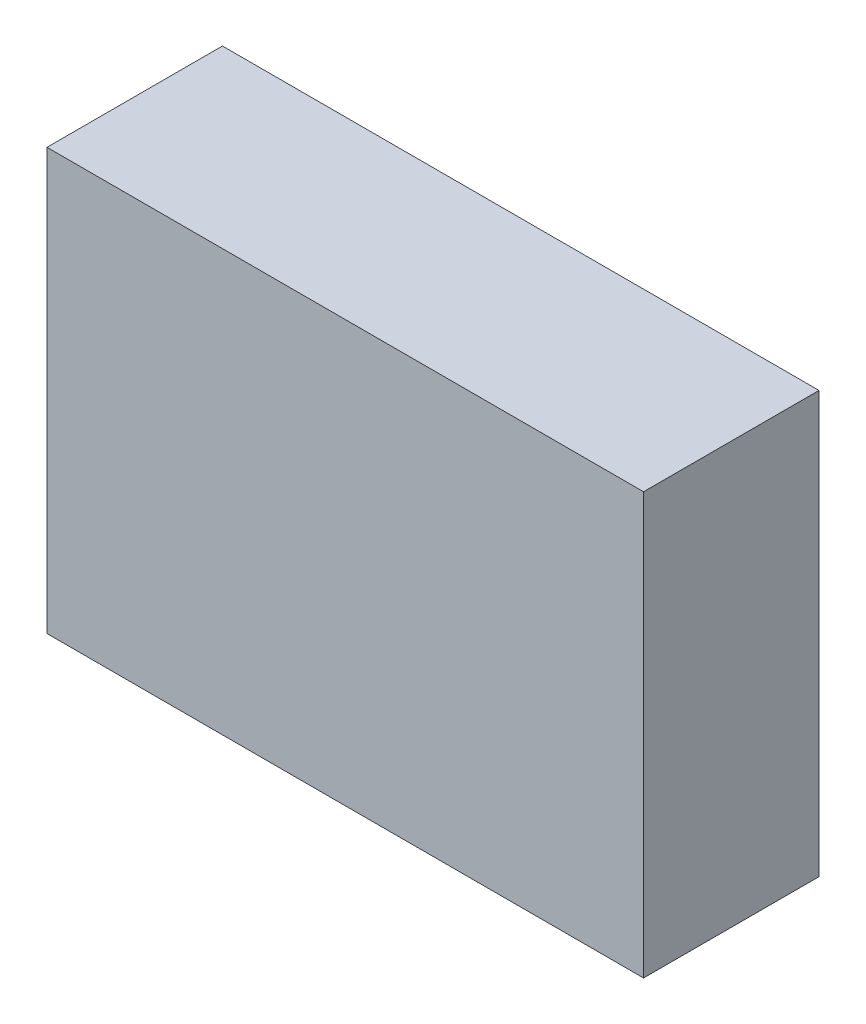
ISO-10303-21;
HEADER;
FILE_DESCRIPTION(('STEP AP214'),'2;1');
FILE_NAME('part.step','',(''),(''),'','','');
FILE_SCHEMA(('AUTOMOTIVE_DESIGN { 1 0 10303 214 1 1 1 1 }'));
ENDSEC;
DATA;
#1=APPLICATION_CONTEXT('core data for automotive mechanical design processes');
#2=APPLICATION_PROTOCOL_DEFINITION('international standard','automotive_design',2000,#1);
#3=PRODUCT_CONTEXT('',#1,'mechanical');
#4=PRODUCT('Part','Part','',(#3));
#5=PRODUCT_RELATED_PRODUCT_CATEGORY('part','',(#4));
#6=PRODUCT_DEFINITION_FORMATION('','',#4);
#7=PRODUCT_DEFINITION_CONTEXT('part definition',#1,'design');
#8=PRODUCT_DEFINITION('design','',#6,#7);
#9=PRODUCT_DEFINITION_SHAPE('','',#8);
#10=(LENGTH_UNIT() NAMED_UNIT(*) SI_UNIT(.MILLI.,.METRE.));
#11=(NAMED_UNIT(*) PLANE_ANGLE_UNIT() SI_UNIT($,.RADIAN.));
#12=(NAMED_UNIT(*) SI_UNIT($,.STERADIAN.) SOLID_ANGLE_UNIT());
#13=UNCERTAINTY_MEASURE_WITH_UNIT(LENGTH_MEASURE(1.E-05),#10,'distance_accuracy_value','');
#14=(GEOMETRIC_REPRESENTATION_CONTEXT(3) GLOBAL_UNCERTAINTY_ASSIGNED_CONTEXT((#13)) GLOBAL_UNIT_ASSIGNED_CONTEXT((#10,
#11,#12)) REPRESENTATION_CONTEXT('',''));
#15=CARTESIAN_POINT('',(0.,0.,0.));
#16=DIRECTION('',(0.,0.,1.));
#17=DIRECTION('',(1.,0.,0.));
#18=AXIS2_PLACEMENT_3D('',#15,#16,#17);
#19=CARTESIAN_POINT('',(-2.92,-1.37,0.));
#20=DIRECTION('',(1.,0.,0.));
#21=DIRECTION('',(0.,0.,1.));
#22=AXIS2_PLACEMENT_3D('',#19,#20,#21);
#23=PLANE('',#22);
#24=DIRECTION('',(0.,1.,0.));
#25=VECTOR('',#24,1.);
#26=CARTESIAN_POINT('',(-2.92,-1.37,0.1));
#27=LINE('',#26,#25);
#28=CARTESIAN_POINT('',(-2.92,-1.37,0.1));
#29=VERTEX_POINT('',#28);
#30=CARTESIAN_POINT('',(-2.92,-1.13,0.1));
#31=VERTEX_POINT('',#30);
#32=EDGE_CURVE('E11',#29,#31,#27,.T.);
#33=ORIENTED_EDGE('',*,*,#32,.T.);
#34=DIRECTION('',(0.,0.,1.));
#35=VECTOR('',#34,1.);
#36=CARTESIAN_POINT('',(-2.92,-1.13,0.));
#37=LINE('',#36,#35);
#38=CARTESIAN_POINT('',(-2.92,-1.13,0.));
#39=VERTEX_POINT('',#38);
#40=EDGE_CURVE('E24',#39,#31,#37,.T.);
#41=ORIENTED_EDGE('',*,*,#40,.F.);
#42=DIRECTION('',(0.,1.,0.));
#43=VECTOR('',#42,1.);
#44=CARTESIAN_POINT('',(-2.92,-1.37,0.));
#45=LINE('',#44,#43);
#46=CARTESIAN_POINT('',(-2.92,-1.37,0.));
#47=VERTEX_POINT('',#46);
#48=EDGE_CURVE('E86',#47,#39,#45,.T.);
#49=ORIENTED_EDGE('',*,*,#48,.F.);
#50=DIRECTION('',(0.,0.,1.));
#51=VECTOR('',#50,1.);
#52=CARTESIAN_POINT('',(-2.92,-1.37,0.));
#53=LINE('',#52,#51);
#54=EDGE_CURVE('E36',#47,#29,#53,.T.);
#55=ORIENTED_EDGE('',*,*,#54,.T.);
#56=EDGE_LOOP('',(#33,#41,#49,#55));
#57=FACE_BOUND('',#56,.T.);
#58=ADVANCED_FACE('F17',(#57),#23,.F.);
#59=CARTESIAN_POINT('',(-2.58,-1.37,0.));
#60=DIRECTION('',(1.,0.,0.));
#61=DIRECTION('',(0.,0.,1.));
#62=AXIS2_PLACEMENT_3D('',#59,#60,#61);
#63=PLANE('',#62);
#64=DIRECTION('',(0.,0.,1.));
#65=VECTOR('',#64,1.);
#66=CARTESIAN_POINT('',(-2.58,-1.37,0.));
#67=LINE('',#66,#65);
#68=CARTESIAN_POINT('',(-2.58,-1.37,0.));
#69=VERTEX_POINT('',#68);
#70=CARTESIAN_POINT('',(-2.58,-1.37,0.1));
#71=VERTEX_POINT('',#70);
#72=EDGE_CURVE('E83',#69,#71,#67,.T.);
#73=ORIENTED_EDGE('',*,*,#72,.F.);
#74=DIRECTION('',(0.,1.,0.));
#75=VECTOR('',#74,1.);
#76=CARTESIAN_POINT('',(-2.58,-1.37,0.));
#77=LINE('',#76,#75);
#78=CARTESIAN_POINT('',(-2.58,-1.13,0.));
#79=VERTEX_POINT('',#78);
#80=EDGE_CURVE('E63',#69,#79,#77,.T.);
#81=ORIENTED_EDGE('',*,*,#80,.T.);
#82=DIRECTION('',(0.,0.,1.));
#83=VECTOR('',#82,1.);
#84=CARTESIAN_POINT('',(-2.58,-1.13,0.));
#85=LINE('',#84,#83);
#86=CARTESIAN_POINT('',(-2.58,-1.13,0.1));
#87=VERTEX_POINT('',#86);
#88=EDGE_CURVE('E57',#79,#87,#85,.T.);
#89=ORIENTED_EDGE('',*,*,#88,.T.);
#90=DIRECTION('',(0.,1.,0.));
#91=VECTOR('',#90,1.);
#92=CARTESIAN_POINT('',(-2.58,-1.37,0.1));
#93=LINE('',#92,#91);
#94=EDGE_CURVE('E60',#71,#87,#93,.T.);
#95=ORIENTED_EDGE('',*,*,#94,.F.);
#96=EDGE_LOOP('',(#73,#81,#89,#95));
#97=FACE_BOUND('',#96,.T.);
#98=ADVANCED_FACE('F59',(#97),#63,.T.);
#99=CARTESIAN_POINT('',(-2.92,-1.37,0.));
#100=DIRECTION('',(0.,1.,0.));
#101=DIRECTION('',(0.,0.,1.));
#102=AXIS2_PLACEMENT_3D('',#99,#100,#101);
#103=PLANE('',#102);
#104=ORIENTED_EDGE('',*,*,#72,.T.);
#105=DIRECTION('',(1.,0.,0.));
#106=VECTOR('',#105,1.);
#107=CARTESIAN_POINT('',(-2.92,-1.37,0.1));
#108=LINE('',#107,#106);
#109=EDGE_CURVE('E71',#29,#71,#108,.T.);
#110=ORIENTED_EDGE('',*,*,#109,.F.);
#111=ORIENTED_EDGE('',*,*,#54,.F.);
#112=DIRECTION('',(1.,0.,0.));
#113=VECTOR('',#112,1.);
#114=CARTESIAN_POINT('',(-2.92,-1.37,0.));
#115=LINE('',#114,#113);
#116=EDGE_CURVE('E76',#47,#69,#115,.T.);
#117=ORIENTED_EDGE('',*,*,#116,.T.);
#118=EDGE_LOOP('',(#104,#110,#111,#117));
#119=FACE_BOUND('',#118,.T.);
#120=ADVANCED_FACE('F91',(#119),#103,.F.);
#121=CARTESIAN_POINT('',(-2.92,-1.13,0.));
#122=DIRECTION('',(0.,1.,0.));
#123=DIRECTION('',(0.,0.,1.));
#124=AXIS2_PLACEMENT_3D('',#121,#122,#123);
#125=PLANE('',#124);
#126=DIRECTION('',(1.,0.,0.));
#127=VECTOR('',#126,1.);
#128=CARTESIAN_POINT('',(-2.92,-1.13,0.));
#129=LINE('',#128,#127);
#130=EDGE_CURVE('E74',#39,#79,#129,.T.);
#131=ORIENTED_EDGE('',*,*,#130,.F.);
#132=ORIENTED_EDGE('',*,*,#40,.T.);
#133=DIRECTION('',(1.,0.,0.));
#134=VECTOR('',#133,1.);
#135=CARTESIAN_POINT('',(-2.92,-1.13,0.1));
#136=LINE('',#135,#134);
#137=EDGE_CURVE('E69',#31,#87,#136,.T.);
#138=ORIENTED_EDGE('',*,*,#137,.T.);
#139=ORIENTED_EDGE('',*,*,#88,.F.);
#140=EDGE_LOOP('',(#131,#132,#138,#139));
#141=FACE_BOUND('',#140,.T.);
#142=ADVANCED_FACE('F73',(#141),#125,.T.);
#143=CARTESIAN_POINT('',(-2.92,-1.37,0.));
#144=DIRECTION('',(0.,0.,1.));
#145=DIRECTION('',(1.,0.,0.));
#146=AXIS2_PLACEMENT_3D('',#143,#144,#145);
#147=PLANE('',#146);
#148=ORIENTED_EDGE('',*,*,#130,.T.);
#149=ORIENTED_EDGE('',*,*,#80,.F.);
#150=ORIENTED_EDGE('',*,*,#116,.F.);
#151=ORIENTED_EDGE('',*,*,#48,.T.);
#152=EDGE_LOOP('',(#148,#149,#150,#151));
#153=FACE_BOUND('',#152,.T.);
#154=ADVANCED_FACE('F89',(#153),#147,.F.);
#155=CARTESIAN_POINT('',(-2.92,-1.37,0.1));
#156=DIRECTION('',(0.,0.,1.));
#157=DIRECTION('',(1.,0.,0.));
#158=AXIS2_PLACEMENT_3D('',#155,#156,#157);
#159=PLANE('',#158);
#160=ORIENTED_EDGE('',*,*,#32,.F.);
#161=ORIENTED_EDGE('',*,*,#109,.T.);
#162=ORIENTED_EDGE('',*,*,#94,.T.);
#163=ORIENTED_EDGE('',*,*,#137,.F.);
#164=EDGE_LOOP('',(#160,#161,#162,#163));
#165=FACE_BOUND('',#164,.T.);
#166=ADVANCED_FACE('F68',(#165),#159,.T.);
#167=CLOSED_SHELL('',(#58,#98,#120,#142,#154,#166));
#168=MANIFOLD_SOLID_BREP('B1',#167);
#169=ADVANCED_BREP_SHAPE_REPRESENTATION('',(#18,#168),#14);
#170=SHAPE_DEFINITION_REPRESENTATION(#9,#169);
ENDSEC;
END-ISO-10303-21;
